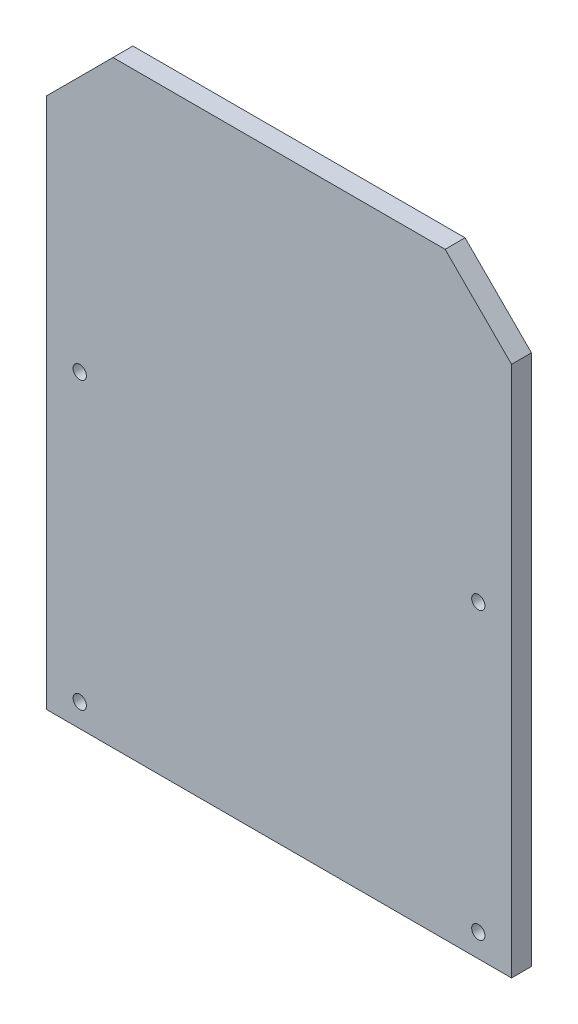
ISO-10303-21;
HEADER;
FILE_DESCRIPTION(('STEP AP214'),'2;1');
FILE_NAME('part.step','',(''),(''),'','','');
FILE_SCHEMA(('AUTOMOTIVE_DESIGN { 1 0 10303 214 1 1 1 1 }'));
ENDSEC;
DATA;
#1=APPLICATION_CONTEXT('core data for automotive mechanical design processes');
#2=APPLICATION_PROTOCOL_DEFINITION('international standard','automotive_design',2000,#1);
#3=PRODUCT_CONTEXT('',#1,'mechanical');
#4=PRODUCT('Part','Part','',(#3));
#5=PRODUCT_RELATED_PRODUCT_CATEGORY('part','',(#4));
#6=PRODUCT_DEFINITION_FORMATION('','',#4);
#7=PRODUCT_DEFINITION_CONTEXT('part definition',#1,'design');
#8=PRODUCT_DEFINITION('design','',#6,#7);
#9=PRODUCT_DEFINITION_SHAPE('','',#8);
#10=(LENGTH_UNIT() NAMED_UNIT(*) SI_UNIT(.MILLI.,.METRE.));
#11=(NAMED_UNIT(*) PLANE_ANGLE_UNIT() SI_UNIT($,.RADIAN.));
#12=(NAMED_UNIT(*) SI_UNIT($,.STERADIAN.) SOLID_ANGLE_UNIT());
#13=UNCERTAINTY_MEASURE_WITH_UNIT(LENGTH_MEASURE(1.E-05),#10,'distance_accuracy_value','');
#14=(GEOMETRIC_REPRESENTATION_CONTEXT(3) GLOBAL_UNCERTAINTY_ASSIGNED_CONTEXT((#13)) GLOBAL_UNIT_ASSIGNED_CONTEXT((#10,
#11,#12)) REPRESENTATION_CONTEXT('',''));
#15=CARTESIAN_POINT('',(0.,0.,0.));
#16=DIRECTION('',(0.,0.,1.));
#17=DIRECTION('',(1.,0.,0.));
#18=AXIS2_PLACEMENT_3D('',#15,#16,#17);
#19=CARTESIAN_POINT('',(-20.0455103864195,36.9283746556474,3.));
#20=DIRECTION('',(0.707106781186548,-0.707106781186548,0.));
#21=DIRECTION('',(0.,0.,1.));
#22=AXIS2_PLACEMENT_3D('',#19,#20,#21);
#23=PLANE('',#22);
#24=DIRECTION('',(0.,0.,1.));
#25=VECTOR('',#24,1.);
#26=CARTESIAN_POINT('',(-20.0455103864195,36.9283746556474,3.));
#27=LINE('',#26,#25);
#28=CARTESIAN_POINT('',(-20.0455103864195,36.9283746556474,0.));
#29=VERTEX_POINT('',#28);
#30=CARTESIAN_POINT('',(-20.0455103864195,36.9283746556474,3.));
#31=VERTEX_POINT('',#30);
#32=EDGE_CURVE('E132',#29,#31,#27,.T.);
#33=ORIENTED_EDGE('',*,*,#32,.F.);
#34=DIRECTION('',(-0.707106781186548,-0.707106781186548,0.));
#35=VECTOR('',#34,1.);
#36=CARTESIAN_POINT('',(-20.0455103864195,36.9283746556474,0.));
#37=LINE('',#36,#35);
#38=CARTESIAN_POINT('',(-30.0455103864195,26.9283746556474,0.));
#39=VERTEX_POINT('',#38);
#40=EDGE_CURVE('E54',#39,#29,#37,.F.);
#41=ORIENTED_EDGE('',*,*,#40,.F.);
#42=DIRECTION('',(0.,0.,-1.));
#43=VECTOR('',#42,1.);
#44=CARTESIAN_POINT('',(-30.0455103864195,26.9283746556474,3.));
#45=LINE('',#44,#43);
#46=CARTESIAN_POINT('',(-30.0455103864195,26.9283746556474,3.));
#47=VERTEX_POINT('',#46);
#48=EDGE_CURVE('E135',#47,#39,#45,.T.);
#49=ORIENTED_EDGE('',*,*,#48,.F.);
#50=DIRECTION('',(0.707106781186548,0.707106781186548,0.));
#51=VECTOR('',#50,1.);
#52=CARTESIAN_POINT('',(-28.4869425210334,28.4869425210334,3.));
#53=LINE('',#52,#51);
#54=EDGE_CURVE('E13',#31,#47,#53,.F.);
#55=ORIENTED_EDGE('',*,*,#54,.F.);
#56=EDGE_LOOP('',(#33,#41,#49,#55));
#57=FACE_BOUND('',#56,.T.);
#58=ADVANCED_FACE('F46',(#57),#23,.F.);
#59=CARTESIAN_POINT('',(39.9544896135805,26.9283746556474,3.));
#60=DIRECTION('',(-0.707106781186547,-0.707106781186548,0.));
#61=DIRECTION('',(0.,0.,1.));
#62=AXIS2_PLACEMENT_3D('',#59,#60,#61);
#63=PLANE('',#62);
#64=DIRECTION('',(0.,0.,1.));
#65=VECTOR('',#64,1.);
#66=CARTESIAN_POINT('',(39.9544896135805,26.9283746556474,3.));
#67=LINE('',#66,#65);
#68=CARTESIAN_POINT('',(39.9544896135805,26.9283746556474,0.));
#69=VERTEX_POINT('',#68);
#70=CARTESIAN_POINT('',(39.9544896135805,26.9283746556474,3.));
#71=VERTEX_POINT('',#70);
#72=EDGE_CURVE('E117',#69,#71,#67,.T.);
#73=ORIENTED_EDGE('',*,*,#72,.F.);
#74=DIRECTION('',(-0.707106781186548,0.707106781186547,0.));
#75=VECTOR('',#74,1.);
#76=CARTESIAN_POINT('',(39.9544896135805,26.9283746556474,0.));
#77=LINE('',#76,#75);
#78=CARTESIAN_POINT('',(29.9544896135805,36.9283746556474,0.));
#79=VERTEX_POINT('',#78);
#80=EDGE_CURVE('E128',#79,#69,#77,.F.);
#81=ORIENTED_EDGE('',*,*,#80,.F.);
#82=DIRECTION('',(0.,0.,-1.));
#83=VECTOR('',#82,1.);
#84=CARTESIAN_POINT('',(29.9544896135805,36.9283746556474,3.));
#85=LINE('',#84,#83);
#86=CARTESIAN_POINT('',(29.9544896135805,36.9283746556474,3.));
#87=VERTEX_POINT('',#86);
#88=EDGE_CURVE('E120',#87,#79,#85,.T.);
#89=ORIENTED_EDGE('',*,*,#88,.F.);
#90=DIRECTION('',(0.707106781186548,-0.707106781186547,0.));
#91=VECTOR('',#90,1.);
#92=CARTESIAN_POINT('',(33.441432134614,33.441432134614,3.));
#93=LINE('',#92,#91);
#94=EDGE_CURVE('E130',#71,#87,#93,.F.);
#95=ORIENTED_EDGE('',*,*,#94,.F.);
#96=EDGE_LOOP('',(#73,#81,#89,#95));
#97=FACE_BOUND('',#96,.T.);
#98=ADVANCED_FACE('F204',(#97),#63,.F.);
#99=CARTESIAN_POINT('',(-30.0455103864195,36.9283746556474,3.));
#100=DIRECTION('',(1.,0.,0.));
#101=DIRECTION('',(0.,1.,0.));
#102=AXIS2_PLACEMENT_3D('',#99,#100,#101);
#103=PLANE('',#102);
#104=DIRECTION('',(0.,-1.,0.));
#105=VECTOR('',#104,1.);
#106=CARTESIAN_POINT('',(-30.0455103864195,36.9283746556474,3.));
#107=LINE('',#106,#105);
#108=CARTESIAN_POINT('',(-30.0455103864195,-53.0716253443526,3.));
#109=VERTEX_POINT('',#108);
#110=EDGE_CURVE('E94',#47,#109,#107,.T.);
#111=ORIENTED_EDGE('',*,*,#110,.F.);
#112=ORIENTED_EDGE('',*,*,#48,.T.);
#113=DIRECTION('',(0.,-1.,0.));
#114=VECTOR('',#113,1.);
#115=CARTESIAN_POINT('',(-30.0455103864195,36.9283746556474,0.));
#116=LINE('',#115,#114);
#117=CARTESIAN_POINT('',(-30.0455103864195,-53.0716253443526,0.));
#118=VERTEX_POINT('',#117);
#119=EDGE_CURVE('E115',#39,#118,#116,.T.);
#120=ORIENTED_EDGE('',*,*,#119,.T.);
#121=DIRECTION('',(0.,0.,-1.));
#122=VECTOR('',#121,1.);
#123=CARTESIAN_POINT('',(-30.0455103864195,-53.0716253443526,3.));
#124=LINE('',#123,#122);
#125=EDGE_CURVE('E107',#109,#118,#124,.T.);
#126=ORIENTED_EDGE('',*,*,#125,.F.);
#127=EDGE_LOOP('',(#111,#112,#120,#126));
#128=FACE_BOUND('',#127,.T.);
#129=ADVANCED_FACE('F113',(#128),#103,.F.);
#130=CARTESIAN_POINT('',(-30.0455103864195,-53.0716253443526,3.));
#131=DIRECTION('',(0.,1.,0.));
#132=DIRECTION('',(0.,0.,1.));
#133=AXIS2_PLACEMENT_3D('',#130,#131,#132);
#134=PLANE('',#133);
#135=DIRECTION('',(1.,0.,0.));
#136=VECTOR('',#135,1.);
#137=CARTESIAN_POINT('',(-30.0455103864195,-53.0716253443526,0.));
#138=LINE('',#137,#136);
#139=CARTESIAN_POINT('',(39.9544896135805,-53.0716253443526,0.));
#140=VERTEX_POINT('',#139);
#141=EDGE_CURVE('E146',#118,#140,#138,.T.);
#142=ORIENTED_EDGE('',*,*,#141,.T.);
#143=DIRECTION('',(0.,0.,-1.));
#144=VECTOR('',#143,1.);
#145=CARTESIAN_POINT('',(39.9544896135805,-53.0716253443526,3.));
#146=LINE('',#145,#144);
#147=CARTESIAN_POINT('',(39.9544896135805,-53.0716253443526,3.));
#148=VERTEX_POINT('',#147);
#149=EDGE_CURVE('E109',#148,#140,#146,.T.);
#150=ORIENTED_EDGE('',*,*,#149,.F.);
#151=DIRECTION('',(1.,0.,0.));
#152=VECTOR('',#151,1.);
#153=CARTESIAN_POINT('',(-30.0455103864195,-53.0716253443526,3.));
#154=LINE('',#153,#152);
#155=EDGE_CURVE('E98',#109,#148,#154,.T.);
#156=ORIENTED_EDGE('',*,*,#155,.F.);
#157=ORIENTED_EDGE('',*,*,#125,.T.);
#158=EDGE_LOOP('',(#142,#150,#156,#157));
#159=FACE_BOUND('',#158,.T.);
#160=ADVANCED_FACE('F106',(#159),#134,.F.);
#161=CARTESIAN_POINT('',(39.9544896135805,36.9283746556474,3.));
#162=DIRECTION('',(-1.,0.,0.));
#163=DIRECTION('',(0.,-1.,0.));
#164=AXIS2_PLACEMENT_3D('',#161,#162,#163);
#165=PLANE('',#164);
#166=DIRECTION('',(0.,1.,0.));
#167=VECTOR('',#166,1.);
#168=CARTESIAN_POINT('',(39.9544896135805,36.9283746556474,0.));
#169=LINE('',#168,#167);
#170=EDGE_CURVE('E144',#140,#69,#169,.T.);
#171=ORIENTED_EDGE('',*,*,#170,.T.);
#172=ORIENTED_EDGE('',*,*,#72,.T.);
#173=DIRECTION('',(0.,1.,0.));
#174=VECTOR('',#173,1.);
#175=CARTESIAN_POINT('',(39.9544896135805,36.9283746556474,3.));
#176=LINE('',#175,#174);
#177=EDGE_CURVE('E111',#148,#71,#176,.T.);
#178=ORIENTED_EDGE('',*,*,#177,.F.);
#179=ORIENTED_EDGE('',*,*,#149,.T.);
#180=EDGE_LOOP('',(#171,#172,#178,#179));
#181=FACE_BOUND('',#180,.T.);
#182=ADVANCED_FACE('F221',(#181),#165,.F.);
#183=CARTESIAN_POINT('',(-30.0455103864195,36.9283746556474,3.));
#184=DIRECTION('',(0.,-1.,0.));
#185=DIRECTION('',(0.,0.,-1.));
#186=AXIS2_PLACEMENT_3D('',#183,#184,#185);
#187=PLANE('',#186);
#188=DIRECTION('',(-1.,0.,0.));
#189=VECTOR('',#188,1.);
#190=CARTESIAN_POINT('',(-30.0455103864195,36.9283746556474,0.));
#191=LINE('',#190,#189);
#192=EDGE_CURVE('E102',#79,#29,#191,.T.);
#193=ORIENTED_EDGE('',*,*,#192,.T.);
#194=ORIENTED_EDGE('',*,*,#32,.T.);
#195=DIRECTION('',(-1.,0.,0.));
#196=VECTOR('',#195,1.);
#197=CARTESIAN_POINT('',(-30.0455103864195,36.9283746556474,3.));
#198=LINE('',#197,#196);
#199=EDGE_CURVE('E122',#87,#31,#198,.T.);
#200=ORIENTED_EDGE('',*,*,#199,.F.);
#201=ORIENTED_EDGE('',*,*,#88,.T.);
#202=EDGE_LOOP('',(#193,#194,#200,#201));
#203=FACE_BOUND('',#202,.T.);
#204=ADVANCED_FACE('F142',(#203),#187,.F.);
#205=CARTESIAN_POINT('',(0.,0.,3.));
#206=DIRECTION('',(0.,0.,1.));
#207=DIRECTION('',(1.,0.,0.));
#208=AXIS2_PLACEMENT_3D('',#205,#206,#207);
#209=PLANE('',#208);
#210=CARTESIAN_POINT('',(-25.0455103864195,-49.5716253443526,3.));
#211=DIRECTION('',(0.,0.,-1.));
#212=DIRECTION('',(-1.,0.,0.));
#213=AXIS2_PLACEMENT_3D('',#210,#211,#212);
#214=CIRCLE('',#213,1.);
#215=CARTESIAN_POINT('',(-26.0455103864195,-49.5716253443526,3.));
#216=VERTEX_POINT('',#215);
#217=EDGE_CURVE('E157',#216,#216,#214,.T.);
#218=ORIENTED_EDGE('',*,*,#217,.T.);
#219=EDGE_LOOP('',(#218));
#220=FACE_BOUND('',#219,.T.);
#221=CARTESIAN_POINT('',(34.9544896135806,-6.57162534435261,3.));
#222=DIRECTION('',(0.,0.,-1.));
#223=DIRECTION('',(-1.,0.,0.));
#224=AXIS2_PLACEMENT_3D('',#221,#222,#223);
#225=CIRCLE('',#224,0.999999999999998);
#226=CARTESIAN_POINT('',(33.9544896135806,-6.57162534435261,3.));
#227=VERTEX_POINT('',#226);
#228=EDGE_CURVE('E163',#227,#227,#225,.T.);
#229=ORIENTED_EDGE('',*,*,#228,.T.);
#230=EDGE_LOOP('',(#229));
#231=FACE_BOUND('',#230,.T.);
#232=CARTESIAN_POINT('',(-25.0455103864195,-6.57162534435261,3.));
#233=DIRECTION('',(0.,0.,-1.));
#234=DIRECTION('',(-1.,0.,0.));
#235=AXIS2_PLACEMENT_3D('',#232,#233,#234);
#236=CIRCLE('',#235,1.);
#237=CARTESIAN_POINT('',(-26.0455103864195,-6.57162534435261,3.));
#238=VERTEX_POINT('',#237);
#239=EDGE_CURVE('E164',#238,#238,#236,.T.);
#240=ORIENTED_EDGE('',*,*,#239,.T.);
#241=EDGE_LOOP('',(#240));
#242=FACE_BOUND('',#241,.T.);
#243=CARTESIAN_POINT('',(34.9544896135806,-49.5716253443526,3.));
#244=DIRECTION('',(0.,0.,-1.));
#245=DIRECTION('',(-1.,0.,0.));
#246=AXIS2_PLACEMENT_3D('',#243,#244,#245);
#247=CIRCLE('',#246,0.999999999999998);
#248=CARTESIAN_POINT('',(33.9544896135806,-49.5716253443526,3.));
#249=VERTEX_POINT('',#248);
#250=EDGE_CURVE('E151',#249,#249,#247,.T.);
#251=ORIENTED_EDGE('',*,*,#250,.T.);
#252=EDGE_LOOP('',(#251));
#253=FACE_BOUND('',#252,.T.);
#254=ORIENTED_EDGE('',*,*,#199,.T.);
#255=ORIENTED_EDGE('',*,*,#54,.T.);
#256=ORIENTED_EDGE('',*,*,#110,.T.);
#257=ORIENTED_EDGE('',*,*,#155,.T.);
#258=ORIENTED_EDGE('',*,*,#177,.T.);
#259=ORIENTED_EDGE('',*,*,#94,.T.);
#260=EDGE_LOOP('',(#254,#255,#256,#257,#258,#259));
#261=FACE_BOUND('',#260,.T.);
#262=ADVANCED_FACE('F96',(#220,#231,#242,#253,#261),#209,.T.);
#263=CARTESIAN_POINT('',(0.,0.,0.));
#264=DIRECTION('',(0.,0.,1.));
#265=DIRECTION('',(1.,0.,0.));
#266=AXIS2_PLACEMENT_3D('',#263,#264,#265);
#267=PLANE('',#266);
#268=CARTESIAN_POINT('',(-25.0455103864195,-49.5716253443526,0.));
#269=DIRECTION('',(0.,0.,-1.));
#270=DIRECTION('',(-1.,0.,0.));
#271=AXIS2_PLACEMENT_3D('',#268,#269,#270);
#272=CIRCLE('',#271,1.);
#273=CARTESIAN_POINT('',(-26.0455103864195,-49.5716253443526,0.));
#274=VERTEX_POINT('',#273);
#275=EDGE_CURVE('E167',#274,#274,#272,.T.);
#276=ORIENTED_EDGE('',*,*,#275,.F.);
#277=EDGE_LOOP('',(#276));
#278=FACE_BOUND('',#277,.T.);
#279=CARTESIAN_POINT('',(34.9544896135806,-6.57162534435261,0.));
#280=DIRECTION('',(0.,0.,-1.));
#281=DIRECTION('',(-1.,0.,0.));
#282=AXIS2_PLACEMENT_3D('',#279,#280,#281);
#283=CIRCLE('',#282,0.999999999999998);
#284=CARTESIAN_POINT('',(33.9544896135806,-6.57162534435261,0.));
#285=VERTEX_POINT('',#284);
#286=EDGE_CURVE('E160',#285,#285,#283,.T.);
#287=ORIENTED_EDGE('',*,*,#286,.F.);
#288=EDGE_LOOP('',(#287));
#289=FACE_BOUND('',#288,.T.);
#290=CARTESIAN_POINT('',(-25.0455103864195,-6.57162534435261,0.));
#291=DIRECTION('',(0.,0.,-1.));
#292=DIRECTION('',(-1.,0.,0.));
#293=AXIS2_PLACEMENT_3D('',#290,#291,#292);
#294=CIRCLE('',#293,1.);
#295=CARTESIAN_POINT('',(-26.0455103864195,-6.57162534435261,0.));
#296=VERTEX_POINT('',#295);
#297=EDGE_CURVE('E172',#296,#296,#294,.T.);
#298=ORIENTED_EDGE('',*,*,#297,.F.);
#299=EDGE_LOOP('',(#298));
#300=FACE_BOUND('',#299,.T.);
#301=CARTESIAN_POINT('',(34.9544896135806,-49.5716253443526,0.));
#302=DIRECTION('',(0.,0.,-1.));
#303=DIRECTION('',(-1.,0.,0.));
#304=AXIS2_PLACEMENT_3D('',#301,#302,#303);
#305=CIRCLE('',#304,0.999999999999998);
#306=CARTESIAN_POINT('',(33.9544896135806,-49.5716253443526,0.));
#307=VERTEX_POINT('',#306);
#308=EDGE_CURVE('E154',#307,#307,#305,.T.);
#309=ORIENTED_EDGE('',*,*,#308,.F.);
#310=EDGE_LOOP('',(#309));
#311=FACE_BOUND('',#310,.T.);
#312=ORIENTED_EDGE('',*,*,#119,.F.);
#313=ORIENTED_EDGE('',*,*,#40,.T.);
#314=ORIENTED_EDGE('',*,*,#192,.F.);
#315=ORIENTED_EDGE('',*,*,#80,.T.);
#316=ORIENTED_EDGE('',*,*,#170,.F.);
#317=ORIENTED_EDGE('',*,*,#141,.F.);
#318=EDGE_LOOP('',(#312,#313,#314,#315,#316,#317));
#319=FACE_BOUND('',#318,.T.);
#320=ADVANCED_FACE('F138',(#278,#289,#300,#311,#319),#267,.F.);
#321=CARTESIAN_POINT('',(34.9544896135806,-49.5716253443526,3.));
#322=DIRECTION('',(0.,0.,-1.));
#323=DIRECTION('',(-1.,0.,0.));
#324=AXIS2_PLACEMENT_3D('',#321,#322,#323);
#325=CYLINDRICAL_SURFACE('',#324,0.999999999999998);
#326=ORIENTED_EDGE('',*,*,#250,.F.);
#327=EDGE_LOOP('',(#326));
#328=FACE_BOUND('',#327,.T.);
#329=ORIENTED_EDGE('',*,*,#308,.T.);
#330=EDGE_LOOP('',(#329));
#331=FACE_BOUND('',#330,.T.);
#332=ADVANCED_FACE('F184',(#328,#331),#325,.F.);
#333=CARTESIAN_POINT('',(-25.0455103864195,-6.57162534435261,3.));
#334=DIRECTION('',(0.,0.,-1.));
#335=DIRECTION('',(-1.,0.,0.));
#336=AXIS2_PLACEMENT_3D('',#333,#334,#335);
#337=CYLINDRICAL_SURFACE('',#336,1.);
#338=ORIENTED_EDGE('',*,*,#239,.F.);
#339=EDGE_LOOP('',(#338));
#340=FACE_BOUND('',#339,.T.);
#341=ORIENTED_EDGE('',*,*,#297,.T.);
#342=EDGE_LOOP('',(#341));
#343=FACE_BOUND('',#342,.T.);
#344=ADVANCED_FACE('F180',(#340,#343),#337,.F.);
#345=CARTESIAN_POINT('',(34.9544896135806,-6.57162534435261,3.));
#346=DIRECTION('',(0.,0.,-1.));
#347=DIRECTION('',(-1.,0.,0.));
#348=AXIS2_PLACEMENT_3D('',#345,#346,#347);
#349=CYLINDRICAL_SURFACE('',#348,0.999999999999998);
#350=ORIENTED_EDGE('',*,*,#228,.F.);
#351=EDGE_LOOP('',(#350));
#352=FACE_BOUND('',#351,.T.);
#353=ORIENTED_EDGE('',*,*,#286,.T.);
#354=EDGE_LOOP('',(#353));
#355=FACE_BOUND('',#354,.T.);
#356=ADVANCED_FACE('F183',(#352,#355),#349,.F.);
#357=CARTESIAN_POINT('',(-25.0455103864195,-49.5716253443526,3.));
#358=DIRECTION('',(0.,0.,-1.));
#359=DIRECTION('',(-1.,0.,0.));
#360=AXIS2_PLACEMENT_3D('',#357,#358,#359);
#361=CYLINDRICAL_SURFACE('',#360,1.);
#362=ORIENTED_EDGE('',*,*,#217,.F.);
#363=EDGE_LOOP('',(#362));
#364=FACE_BOUND('',#363,.T.);
#365=ORIENTED_EDGE('',*,*,#275,.T.);
#366=EDGE_LOOP('',(#365));
#367=FACE_BOUND('',#366,.T.);
#368=ADVANCED_FACE('F236',(#364,#367),#361,.F.);
#369=CLOSED_SHELL('',(#58,#98,#129,#160,#182,#204,#262,#320,#332,#344,#356,#368));
#370=MANIFOLD_SOLID_BREP('B2',#369);
#371=ADVANCED_BREP_SHAPE_REPRESENTATION('',(#18,#370),#14);
#372=SHAPE_DEFINITION_REPRESENTATION(#9,#371);
ENDSEC;
END-ISO-10303-21;
